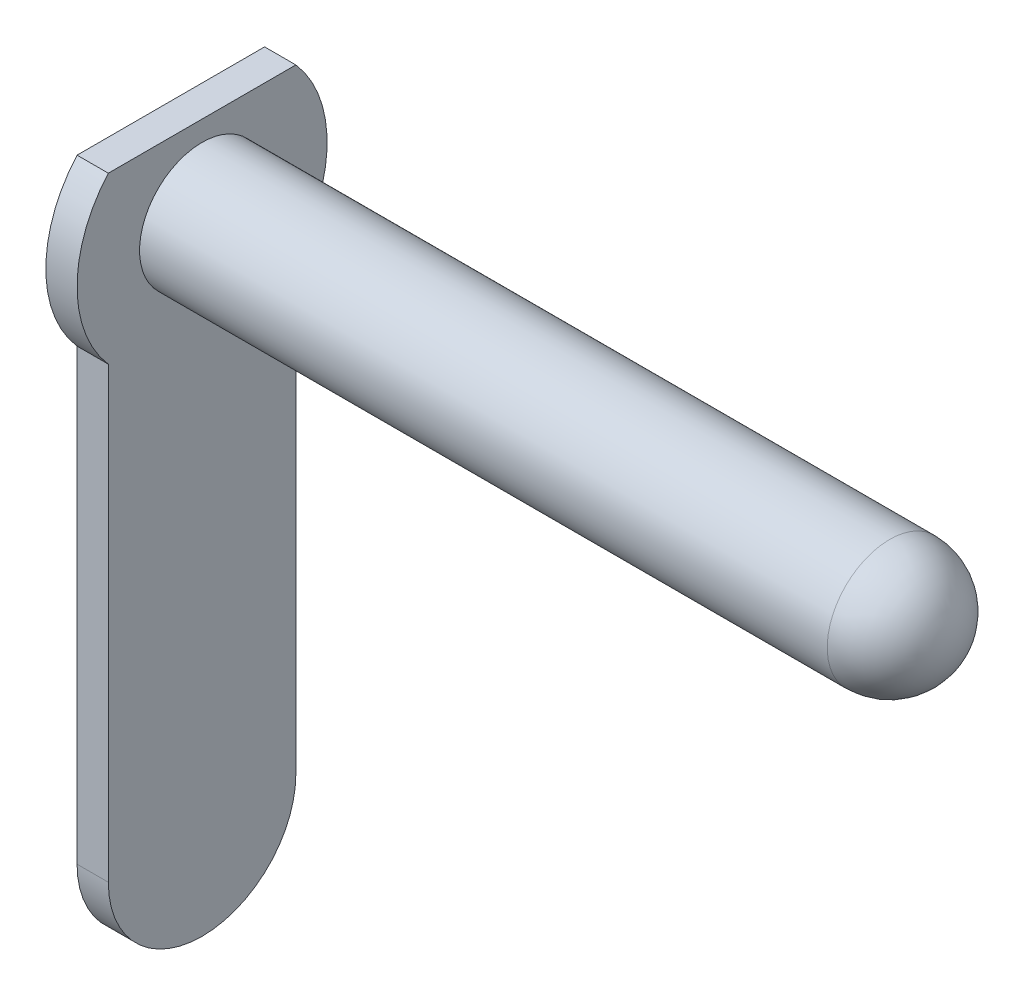
ISO-10303-21;
HEADER;
FILE_DESCRIPTION(('STEP AP214'),'2;1');
FILE_NAME('part.step','',(''),(''),'','','');
FILE_SCHEMA(('AUTOMOTIVE_DESIGN { 1 0 10303 214 1 1 1 1 }'));
ENDSEC;
DATA;
#1=APPLICATION_CONTEXT('core data for automotive mechanical design processes');
#2=APPLICATION_PROTOCOL_DEFINITION('international standard','automotive_design',2000,#1);
#3=PRODUCT_CONTEXT('',#1,'mechanical');
#4=PRODUCT('Part','Part','',(#3));
#5=PRODUCT_RELATED_PRODUCT_CATEGORY('part','',(#4));
#6=PRODUCT_DEFINITION_FORMATION('','',#4);
#7=PRODUCT_DEFINITION_CONTEXT('part definition',#1,'design');
#8=PRODUCT_DEFINITION('design','',#6,#7);
#9=PRODUCT_DEFINITION_SHAPE('','',#8);
#10=(LENGTH_UNIT() NAMED_UNIT(*) SI_UNIT(.MILLI.,.METRE.));
#11=(NAMED_UNIT(*) PLANE_ANGLE_UNIT() SI_UNIT($,.RADIAN.));
#12=(NAMED_UNIT(*) SI_UNIT($,.STERADIAN.) SOLID_ANGLE_UNIT());
#13=UNCERTAINTY_MEASURE_WITH_UNIT(LENGTH_MEASURE(1.E-05),#10,'distance_accuracy_value','');
#14=(GEOMETRIC_REPRESENTATION_CONTEXT(3) GLOBAL_UNCERTAINTY_ASSIGNED_CONTEXT((#13)) GLOBAL_UNIT_ASSIGNED_CONTEXT((#10,
#11,#12)) REPRESENTATION_CONTEXT('',''));
#15=CARTESIAN_POINT('',(0.,0.,0.));
#16=DIRECTION('',(0.,0.,1.));
#17=DIRECTION('',(1.,0.,0.));
#18=AXIS2_PLACEMENT_3D('',#15,#16,#17);
#19=CARTESIAN_POINT('',(0.5,0.,-1.5));
#20=DIRECTION('',(-1.,0.,0.));
#21=DIRECTION('',(0.,0.,1.));
#22=AXIS2_PLACEMENT_3D('',#19,#20,#21);
#23=CYLINDRICAL_SURFACE('',#22,1.5);
#24=CARTESIAN_POINT('',(0.,0.,-1.5));
#25=DIRECTION('',(1.,0.,0.));
#26=DIRECTION('',(0.,0.,-1.));
#27=AXIS2_PLACEMENT_3D('',#24,#25,#26);
#28=CIRCLE('',#27,1.5);
#29=CARTESIAN_POINT('',(0.,0.,0.));
#30=VERTEX_POINT('',#29);
#31=CARTESIAN_POINT('',(0.,0.,-3.));
#32=VERTEX_POINT('',#31);
#33=EDGE_CURVE('E120',#30,#32,#28,.T.);
#34=ORIENTED_EDGE('',*,*,#33,.T.);
#35=DIRECTION('',(-1.,0.,0.));
#36=VECTOR('',#35,1.);
#37=CARTESIAN_POINT('',(0.5,0.,-3.));
#38=LINE('',#37,#36);
#39=CARTESIAN_POINT('',(0.5,0.,-3.));
#40=VERTEX_POINT('',#39);
#41=EDGE_CURVE('E138',#40,#32,#38,.T.);
#42=ORIENTED_EDGE('',*,*,#41,.F.);
#43=CARTESIAN_POINT('',(0.5,0.,-1.5));
#44=DIRECTION('',(1.,0.,0.));
#45=DIRECTION('',(0.,0.,-1.));
#46=AXIS2_PLACEMENT_3D('',#43,#44,#45);
#47=CIRCLE('',#46,1.5);
#48=CARTESIAN_POINT('',(0.5,0.,0.));
#49=VERTEX_POINT('',#48);
#50=EDGE_CURVE('E131',#49,#40,#47,.T.);
#51=ORIENTED_EDGE('',*,*,#50,.F.);
#52=DIRECTION('',(-1.,0.,0.));
#53=VECTOR('',#52,1.);
#54=CARTESIAN_POINT('',(0.5,0.,0.));
#55=LINE('',#54,#53);
#56=EDGE_CURVE('E116',#49,#30,#55,.T.);
#57=ORIENTED_EDGE('',*,*,#56,.T.);
#58=EDGE_LOOP('',(#34,#42,#51,#57));
#59=FACE_BOUND('',#58,.T.);
#60=ADVANCED_FACE('F33',(#59),#23,.T.);
#61=CARTESIAN_POINT('',(0.5,7.17712434446771,-3.));
#62=DIRECTION('',(0.,0.,1.));
#63=DIRECTION('',(1.,0.,0.));
#64=AXIS2_PLACEMENT_3D('',#61,#62,#63);
#65=PLANE('',#64);
#66=DIRECTION('',(0.,1.,0.));
#67=VECTOR('',#66,1.);
#68=CARTESIAN_POINT('',(0.,7.17712434446771,-3.));
#69=LINE('',#68,#67);
#70=CARTESIAN_POINT('',(0.,7.1771243444677,-3.));
#71=VERTEX_POINT('',#70);
#72=EDGE_CURVE('E123',#32,#71,#69,.T.);
#73=ORIENTED_EDGE('',*,*,#72,.T.);
#74=DIRECTION('',(-1.,0.,0.));
#75=VECTOR('',#74,1.);
#76=CARTESIAN_POINT('',(0.5,7.1771243444677,-3.));
#77=LINE('',#76,#75);
#78=CARTESIAN_POINT('',(0.5,7.1771243444677,-3.));
#79=VERTEX_POINT('',#78);
#80=EDGE_CURVE('E135',#79,#71,#77,.T.);
#81=ORIENTED_EDGE('',*,*,#80,.F.);
#82=DIRECTION('',(0.,1.,0.));
#83=VECTOR('',#82,1.);
#84=CARTESIAN_POINT('',(0.5,7.17712434446771,-3.));
#85=LINE('',#84,#83);
#86=EDGE_CURVE('E89',#40,#79,#85,.T.);
#87=ORIENTED_EDGE('',*,*,#86,.F.);
#88=ORIENTED_EDGE('',*,*,#41,.T.);
#89=EDGE_LOOP('',(#73,#81,#87,#88));
#90=FACE_BOUND('',#89,.T.);
#91=ADVANCED_FACE('F189',(#90),#65,.F.);
#92=CARTESIAN_POINT('',(0.5,8.5,-1.5));
#93=DIRECTION('',(-1.,0.,0.));
#94=DIRECTION('',(0.,0.,1.));
#95=AXIS2_PLACEMENT_3D('',#92,#93,#94);
#96=CYLINDRICAL_SURFACE('',#95,2.);
#97=CARTESIAN_POINT('',(0.,8.5,-1.5));
#98=DIRECTION('',(1.,0.,0.));
#99=DIRECTION('',(0.,0.,-1.));
#100=AXIS2_PLACEMENT_3D('',#97,#98,#99);
#101=CIRCLE('',#100,2.);
#102=CARTESIAN_POINT('',(0.,9.82287565553229,-3.));
#103=VERTEX_POINT('',#102);
#104=EDGE_CURVE('E126',#71,#103,#101,.T.);
#105=ORIENTED_EDGE('',*,*,#104,.T.);
#106=DIRECTION('',(-1.,0.,0.));
#107=VECTOR('',#106,1.);
#108=CARTESIAN_POINT('',(0.5,9.82287565553229,-3.));
#109=LINE('',#108,#107);
#110=CARTESIAN_POINT('',(0.5,9.82287565553229,-3.));
#111=VERTEX_POINT('',#110);
#112=EDGE_CURVE('E111',#111,#103,#109,.T.);
#113=ORIENTED_EDGE('',*,*,#112,.F.);
#114=CARTESIAN_POINT('',(0.5,8.5,-1.5));
#115=DIRECTION('',(1.,0.,0.));
#116=DIRECTION('',(0.,0.,-1.));
#117=AXIS2_PLACEMENT_3D('',#114,#115,#116);
#118=CIRCLE('',#117,2.);
#119=EDGE_CURVE('E102',#79,#111,#118,.T.);
#120=ORIENTED_EDGE('',*,*,#119,.F.);
#121=ORIENTED_EDGE('',*,*,#80,.T.);
#122=EDGE_LOOP('',(#105,#113,#120,#121));
#123=FACE_BOUND('',#122,.T.);
#124=ADVANCED_FACE('F194',(#123),#96,.T.);
#125=CARTESIAN_POINT('',(0.5,9.82287565553229,0.));
#126=DIRECTION('',(0.,-1.,0.));
#127=DIRECTION('',(0.,0.,-1.));
#128=AXIS2_PLACEMENT_3D('',#125,#126,#127);
#129=PLANE('',#128);
#130=DIRECTION('',(0.,0.,1.));
#131=VECTOR('',#130,1.);
#132=CARTESIAN_POINT('',(0.,9.82287565553229,0.));
#133=LINE('',#132,#131);
#134=CARTESIAN_POINT('',(0.,9.82287565553229,0.));
#135=VERTEX_POINT('',#134);
#136=EDGE_CURVE('E110',#103,#135,#133,.T.);
#137=ORIENTED_EDGE('',*,*,#136,.T.);
#138=DIRECTION('',(-1.,0.,0.));
#139=VECTOR('',#138,1.);
#140=CARTESIAN_POINT('',(0.5,9.82287565553229,0.));
#141=LINE('',#140,#139);
#142=CARTESIAN_POINT('',(0.5,9.82287565553229,0.));
#143=VERTEX_POINT('',#142);
#144=EDGE_CURVE('E107',#143,#135,#141,.T.);
#145=ORIENTED_EDGE('',*,*,#144,.F.);
#146=DIRECTION('',(0.,0.,1.));
#147=VECTOR('',#146,1.);
#148=CARTESIAN_POINT('',(0.5,9.82287565553229,0.));
#149=LINE('',#148,#147);
#150=EDGE_CURVE('E96',#111,#143,#149,.T.);
#151=ORIENTED_EDGE('',*,*,#150,.F.);
#152=ORIENTED_EDGE('',*,*,#112,.T.);
#153=EDGE_LOOP('',(#137,#145,#151,#152));
#154=FACE_BOUND('',#153,.T.);
#155=ADVANCED_FACE('F108',(#154),#129,.F.);
#156=CARTESIAN_POINT('',(0.5,8.5,-1.5));
#157=DIRECTION('',(-1.,0.,0.));
#158=DIRECTION('',(0.,0.,1.));
#159=AXIS2_PLACEMENT_3D('',#156,#157,#158);
#160=CYLINDRICAL_SURFACE('',#159,2.);
#161=CARTESIAN_POINT('',(0.,8.5,-1.5));
#162=DIRECTION('',(1.,0.,0.));
#163=DIRECTION('',(0.,0.,-1.));
#164=AXIS2_PLACEMENT_3D('',#161,#162,#163);
#165=CIRCLE('',#164,2.);
#166=CARTESIAN_POINT('',(0.,7.17712434446771,0.));
#167=VERTEX_POINT('',#166);
#168=EDGE_CURVE('E74',#135,#167,#165,.T.);
#169=ORIENTED_EDGE('',*,*,#168,.T.);
#170=DIRECTION('',(-1.,0.,0.));
#171=VECTOR('',#170,1.);
#172=CARTESIAN_POINT('',(0.5,7.17712434446771,0.));
#173=LINE('',#172,#171);
#174=CARTESIAN_POINT('',(0.5,7.17712434446771,0.));
#175=VERTEX_POINT('',#174);
#176=EDGE_CURVE('E112',#175,#167,#173,.T.);
#177=ORIENTED_EDGE('',*,*,#176,.F.);
#178=CARTESIAN_POINT('',(0.5,8.5,-1.5));
#179=DIRECTION('',(1.,0.,0.));
#180=DIRECTION('',(0.,0.,-1.));
#181=AXIS2_PLACEMENT_3D('',#178,#179,#180);
#182=CIRCLE('',#181,2.);
#183=EDGE_CURVE('E100',#143,#175,#182,.T.);
#184=ORIENTED_EDGE('',*,*,#183,.F.);
#185=ORIENTED_EDGE('',*,*,#144,.T.);
#186=EDGE_LOOP('',(#169,#177,#184,#185));
#187=FACE_BOUND('',#186,.T.);
#188=ADVANCED_FACE('F114',(#187),#160,.T.);
#189=CARTESIAN_POINT('',(0.5,0.,0.));
#190=DIRECTION('',(0.,0.,-1.));
#191=DIRECTION('',(-1.,0.,0.));
#192=AXIS2_PLACEMENT_3D('',#189,#190,#191);
#193=PLANE('',#192);
#194=DIRECTION('',(0.,-1.,0.));
#195=VECTOR('',#194,1.);
#196=CARTESIAN_POINT('',(0.,0.,0.));
#197=LINE('',#196,#195);
#198=EDGE_CURVE('E80',#167,#30,#197,.T.);
#199=ORIENTED_EDGE('',*,*,#198,.T.);
#200=ORIENTED_EDGE('',*,*,#56,.F.);
#201=DIRECTION('',(0.,-1.,0.));
#202=VECTOR('',#201,1.);
#203=CARTESIAN_POINT('',(0.5,0.,0.));
#204=LINE('',#203,#202);
#205=EDGE_CURVE('E51',#175,#49,#204,.T.);
#206=ORIENTED_EDGE('',*,*,#205,.F.);
#207=ORIENTED_EDGE('',*,*,#176,.T.);
#208=EDGE_LOOP('',(#199,#200,#206,#207));
#209=FACE_BOUND('',#208,.T.);
#210=ADVANCED_FACE('F178',(#209),#193,.F.);
#211=CARTESIAN_POINT('',(0.5,0.,-1.5));
#212=DIRECTION('',(1.,0.,0.));
#213=DIRECTION('',(0.,0.,-1.));
#214=AXIS2_PLACEMENT_3D('',#211,#212,#213);
#215=PLANE('',#214);
#216=CARTESIAN_POINT('',(0.5,8.5,-1.5));
#217=DIRECTION('',(1.,0.,0.));
#218=DIRECTION('',(0.,0.,-1.));
#219=AXIS2_PLACEMENT_3D('',#216,#217,#218);
#220=CIRCLE('',#219,1.);
#221=CARTESIAN_POINT('',(0.5,8.5,-2.5));
#222=VERTEX_POINT('',#221);
#223=EDGE_CURVE('E140',#222,#222,#220,.T.);
#224=ORIENTED_EDGE('',*,*,#223,.F.);
#225=EDGE_LOOP('',(#224));
#226=FACE_BOUND('',#225,.T.);
#227=ORIENTED_EDGE('',*,*,#50,.T.);
#228=ORIENTED_EDGE('',*,*,#86,.T.);
#229=ORIENTED_EDGE('',*,*,#119,.T.);
#230=ORIENTED_EDGE('',*,*,#150,.T.);
#231=ORIENTED_EDGE('',*,*,#183,.T.);
#232=ORIENTED_EDGE('',*,*,#205,.T.);
#233=EDGE_LOOP('',(#227,#228,#229,#230,#231,#232));
#234=FACE_BOUND('',#233,.T.);
#235=ADVANCED_FACE('F98',(#226,#234),#215,.T.);
#236=CARTESIAN_POINT('',(0.,0.,-1.5));
#237=DIRECTION('',(1.,0.,0.));
#238=DIRECTION('',(0.,0.,-1.));
#239=AXIS2_PLACEMENT_3D('',#236,#237,#238);
#240=PLANE('',#239);
#241=CARTESIAN_POINT('',(0.,8.5,-1.5));
#242=DIRECTION('',(1.,0.,0.));
#243=DIRECTION('',(0.,0.,-1.));
#244=AXIS2_PLACEMENT_3D('',#241,#242,#243);
#245=CIRCLE('',#244,1.);
#246=CARTESIAN_POINT('',(0.,8.5,-2.5));
#247=VERTEX_POINT('',#246);
#248=EDGE_CURVE('E124',#247,#247,#245,.T.);
#249=ORIENTED_EDGE('',*,*,#248,.T.);
#250=EDGE_LOOP('',(#249));
#251=FACE_BOUND('',#250,.T.);
#252=ORIENTED_EDGE('',*,*,#33,.F.);
#253=ORIENTED_EDGE('',*,*,#198,.F.);
#254=ORIENTED_EDGE('',*,*,#168,.F.);
#255=ORIENTED_EDGE('',*,*,#136,.F.);
#256=ORIENTED_EDGE('',*,*,#104,.F.);
#257=ORIENTED_EDGE('',*,*,#72,.F.);
#258=EDGE_LOOP('',(#252,#253,#254,#255,#256,#257));
#259=FACE_BOUND('',#258,.T.);
#260=ADVANCED_FACE('F168',(#251,#259),#240,.F.);
#261=CARTESIAN_POINT('',(-0.0999999999999999,8.5,-1.5));
#262=DIRECTION('',(1.,0.,0.));
#263=DIRECTION('',(0.,0.,-1.));
#264=AXIS2_PLACEMENT_3D('',#261,#262,#263);
#265=CYLINDRICAL_SURFACE('',#264,1.);
#266=CARTESIAN_POINT('',(11.5,8.5,-1.5));
#267=DIRECTION('',(1.,0.,0.));
#268=DIRECTION('',(0.,0.,-1.));
#269=AXIS2_PLACEMENT_3D('',#266,#267,#268);
#270=CIRCLE('',#269,1.);
#271=CARTESIAN_POINT('',(11.5,8.5,-2.5));
#272=VERTEX_POINT('',#271);
#273=EDGE_CURVE('E143',#272,#272,#270,.F.);
#274=ORIENTED_EDGE('',*,*,#273,.T.);
#275=EDGE_LOOP('',(#274));
#276=FACE_BOUND('',#275,.T.);
#277=ORIENTED_EDGE('',*,*,#223,.T.);
#278=EDGE_LOOP('',(#277));
#279=FACE_BOUND('',#278,.T.);
#280=ADVANCED_FACE('F171',(#276,#279),#265,.T.);
#281=CARTESIAN_POINT('',(11.5,8.5,-1.5));
#282=DIRECTION('',(1.,0.,0.));
#283=DIRECTION('',(0.,0.,-1.));
#284=AXIS2_PLACEMENT_3D('',#281,#282,#283);
#285=SPHERICAL_SURFACE('',#284,1.);
#286=ORIENTED_EDGE('',*,*,#273,.F.);
#287=EDGE_LOOP('',(#286));
#288=FACE_BOUND('',#287,.T.);
#289=ADVANCED_FACE('F198',(#288),#285,.T.);
#290=CARTESIAN_POINT('',(0.4,8.5,-1.5));
#291=DIRECTION('',(-1.,0.,0.));
#292=DIRECTION('',(0.,0.,1.));
#293=AXIS2_PLACEMENT_3D('',#290,#291,#292);
#294=CYLINDRICAL_SURFACE('',#293,0.8);
#295=CARTESIAN_POINT('',(0.,8.5,-1.5));
#296=DIRECTION('',(1.,0.,0.));
#297=DIRECTION('',(0.,0.,-1.));
#298=AXIS2_PLACEMENT_3D('',#295,#296,#297);
#299=CIRCLE('',#298,0.8);
#300=CARTESIAN_POINT('',(0.,8.5,-2.3));
#301=VERTEX_POINT('',#300);
#302=EDGE_CURVE('E43',#301,#301,#299,.F.);
#303=ORIENTED_EDGE('',*,*,#302,.T.);
#304=EDGE_LOOP('',(#303));
#305=FACE_BOUND('',#304,.T.);
#306=CARTESIAN_POINT('',(0.3,8.5,-1.5));
#307=DIRECTION('',(-1.,0.,0.));
#308=DIRECTION('',(0.,0.,1.));
#309=AXIS2_PLACEMENT_3D('',#306,#307,#308);
#310=CIRCLE('',#309,0.8);
#311=CARTESIAN_POINT('',(0.3,8.5,-0.7));
#312=VERTEX_POINT('',#311);
#313=EDGE_CURVE('E146',#312,#312,#310,.F.);
#314=ORIENTED_EDGE('',*,*,#313,.T.);
#315=EDGE_LOOP('',(#314));
#316=FACE_BOUND('',#315,.T.);
#317=ADVANCED_FACE('F152',(#305,#316),#294,.F.);
#318=CARTESIAN_POINT('',(0.4,8.5,-1.5));
#319=DIRECTION('',(-1.,0.,0.));
#320=DIRECTION('',(0.,0.,1.));
#321=AXIS2_PLACEMENT_3D('',#318,#319,#320);
#322=PLANE('',#321);
#323=CARTESIAN_POINT('',(0.4,8.5,-1.5));
#324=DIRECTION('',(-1.,0.,0.));
#325=DIRECTION('',(0.,0.,1.));
#326=AXIS2_PLACEMENT_3D('',#323,#324,#325);
#327=CIRCLE('',#326,0.7);
#328=CARTESIAN_POINT('',(0.4,8.5,-0.8));
#329=VERTEX_POINT('',#328);
#330=EDGE_CURVE('E11',#329,#329,#327,.T.);
#331=ORIENTED_EDGE('',*,*,#330,.T.);
#332=EDGE_LOOP('',(#331));
#333=FACE_BOUND('',#332,.T.);
#334=ADVANCED_FACE('F159',(#333),#322,.T.);
#335=CARTESIAN_POINT('',(0.,8.5,-1.5));
#336=DIRECTION('',(1.,0.,0.));
#337=DIRECTION('',(0.,0.,-1.));
#338=AXIS2_PLACEMENT_3D('',#335,#336,#337);
#339=TOROIDAL_SURFACE('',#338,0.9,0.1);
#340=ORIENTED_EDGE('',*,*,#302,.F.);
#341=EDGE_LOOP('',(#340));
#342=FACE_BOUND('',#341,.T.);
#343=CARTESIAN_POINT('',(-0.0999999999999999,8.5,-1.5));
#344=DIRECTION('',(1.,0.,0.));
#345=DIRECTION('',(0.,0.,-1.));
#346=AXIS2_PLACEMENT_3D('',#343,#344,#345);
#347=CIRCLE('',#346,0.9);
#348=CARTESIAN_POINT('',(-0.0999999999999999,8.5,-2.4));
#349=VERTEX_POINT('',#348);
#350=EDGE_CURVE('E37',#349,#349,#347,.T.);
#351=ORIENTED_EDGE('',*,*,#350,.F.);
#352=EDGE_LOOP('',(#351));
#353=FACE_BOUND('',#352,.T.);
#354=ADVANCED_FACE('F155',(#342,#353),#339,.T.);
#355=CARTESIAN_POINT('',(0.,8.5,-1.5));
#356=DIRECTION('',(1.,0.,0.));
#357=DIRECTION('',(0.,0.,-1.));
#358=AXIS2_PLACEMENT_3D('',#355,#356,#357);
#359=TOROIDAL_SURFACE('',#358,0.9,0.1);
#360=ORIENTED_EDGE('',*,*,#350,.T.);
#361=EDGE_LOOP('',(#360));
#362=FACE_BOUND('',#361,.T.);
#363=ORIENTED_EDGE('',*,*,#248,.F.);
#364=EDGE_LOOP('',(#363));
#365=FACE_BOUND('',#364,.T.);
#366=ADVANCED_FACE('F158',(#362,#365),#359,.T.);
#367=CARTESIAN_POINT('',(0.3,8.5,-1.5));
#368=DIRECTION('',(-1.,0.,0.));
#369=DIRECTION('',(0.,0.,1.));
#370=AXIS2_PLACEMENT_3D('',#367,#368,#369);
#371=TOROIDAL_SURFACE('',#370,0.7,0.1);
#372=ORIENTED_EDGE('',*,*,#313,.F.);
#373=EDGE_LOOP('',(#372));
#374=FACE_BOUND('',#373,.T.);
#375=ORIENTED_EDGE('',*,*,#330,.F.);
#376=EDGE_LOOP('',(#375));
#377=FACE_BOUND('',#376,.T.);
#378=ADVANCED_FACE('F35',(#374,#377),#371,.F.);
#379=CLOSED_SHELL('',(#60,#91,#124,#155,#188,#210,#235,#260,#280,#289,#317,#334,#354,#366,#378));
#380=MANIFOLD_SOLID_BREP('B2',#379);
#381=ADVANCED_BREP_SHAPE_REPRESENTATION('',(#18,#380),#14);
#382=SHAPE_DEFINITION_REPRESENTATION(#9,#381);
ENDSEC;
END-ISO-10303-21;
